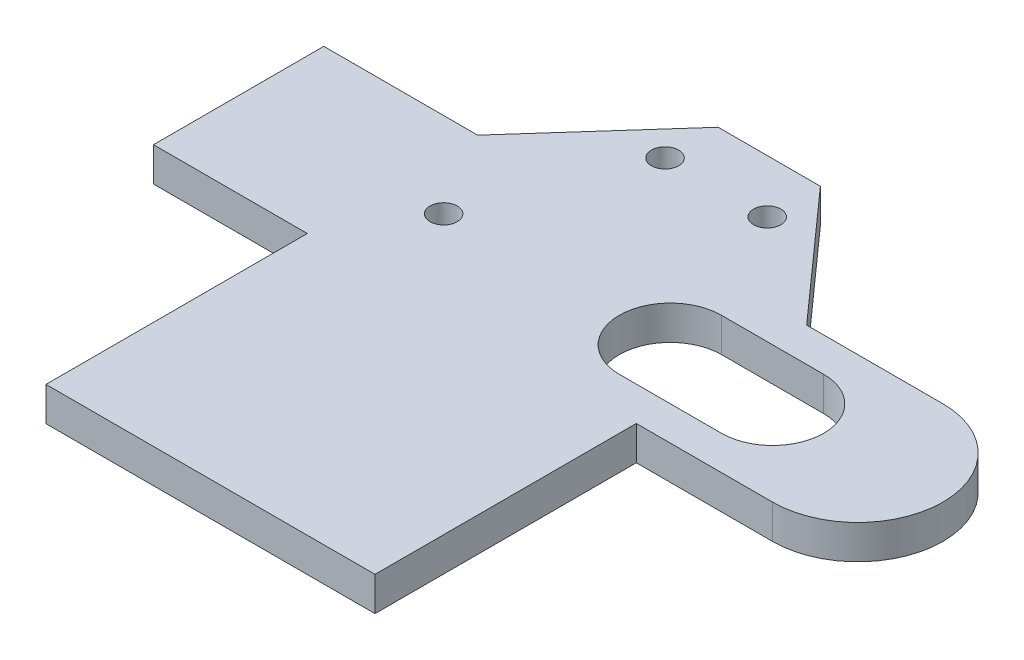
ISO-10303-21;
HEADER;
FILE_DESCRIPTION(('STEP AP214'),'2;1');
FILE_NAME('part.step','',(''),(''),'','','');
FILE_SCHEMA(('AUTOMOTIVE_DESIGN { 1 0 10303 214 1 1 1 1 }'));
ENDSEC;
DATA;
#1=APPLICATION_CONTEXT('core data for automotive mechanical design processes');
#2=APPLICATION_PROTOCOL_DEFINITION('international standard','automotive_design',2000,#1);
#3=PRODUCT_CONTEXT('',#1,'mechanical');
#4=PRODUCT('Part','Part','',(#3));
#5=PRODUCT_RELATED_PRODUCT_CATEGORY('part','',(#4));
#6=PRODUCT_DEFINITION_FORMATION('','',#4);
#7=PRODUCT_DEFINITION_CONTEXT('part definition',#1,'design');
#8=PRODUCT_DEFINITION('design','',#6,#7);
#9=PRODUCT_DEFINITION_SHAPE('','',#8);
#10=(LENGTH_UNIT() NAMED_UNIT(*) SI_UNIT(.MILLI.,.METRE.));
#11=(NAMED_UNIT(*) PLANE_ANGLE_UNIT() SI_UNIT($,.RADIAN.));
#12=(NAMED_UNIT(*) SI_UNIT($,.STERADIAN.) SOLID_ANGLE_UNIT());
#13=UNCERTAINTY_MEASURE_WITH_UNIT(LENGTH_MEASURE(1.E-05),#10,'distance_accuracy_value','');
#14=(GEOMETRIC_REPRESENTATION_CONTEXT(3) GLOBAL_UNCERTAINTY_ASSIGNED_CONTEXT((#13)) GLOBAL_UNIT_ASSIGNED_CONTEXT((#10,
#11,#12)) REPRESENTATION_CONTEXT('',''));
#15=CARTESIAN_POINT('',(0.,0.,0.));
#16=DIRECTION('',(0.,0.,1.));
#17=DIRECTION('',(1.,0.,0.));
#18=AXIS2_PLACEMENT_3D('',#15,#16,#17);
#19=CARTESIAN_POINT('',(64.0800899701705,7.5,-42.8143245307051));
#20=DIRECTION('',(0.,-1.,0.));
#21=DIRECTION('',(0.,0.,-1.));
#22=AXIS2_PLACEMENT_3D('',#19,#20,#21);
#23=PLANE('',#22);
#24=CARTESIAN_POINT('',(3.29581872270843,7.5,-42.8143245307051));
#25=DIRECTION('',(0.,1.,0.));
#26=DIRECTION('',(0.,0.,1.));
#27=AXIS2_PLACEMENT_3D('',#24,#25,#26);
#28=CIRCLE('',#27,2.);
#29=CARTESIAN_POINT('',(3.29581872270843,7.5,-40.8143245307051));
#30=VERTEX_POINT('',#29);
#31=EDGE_CURVE('E183',#30,#30,#28,.T.);
#32=ORIENTED_EDGE('',*,*,#31,.F.);
#33=EDGE_LOOP('',(#32));
#34=FACE_BOUND('',#33,.T.);
#35=CARTESIAN_POINT('',(27.4379543464394,7.5,-66.1721889069742));
#36=DIRECTION('',(0.,1.,0.));
#37=DIRECTION('',(0.,0.,1.));
#38=AXIS2_PLACEMENT_3D('',#35,#36,#37);
#39=CIRCLE('',#38,2.00000000000001);
#40=CARTESIAN_POINT('',(27.4379543464394,7.5,-64.1721889069742));
#41=VERTEX_POINT('',#40);
#42=EDGE_CURVE('E189',#41,#41,#39,.T.);
#43=ORIENTED_EDGE('',*,*,#42,.F.);
#44=EDGE_LOOP('',(#43));
#45=FACE_BOUND('',#44,.T.);
#46=CARTESIAN_POINT('',(12.4379543464394,7.5,-66.1721889069742));
#47=DIRECTION('',(0.,1.,0.));
#48=DIRECTION('',(0.,0.,1.));
#49=AXIS2_PLACEMENT_3D('',#46,#47,#48);
#50=CIRCLE('',#49,2.);
#51=CARTESIAN_POINT('',(12.4379543464394,7.5,-64.1721889069742));
#52=VERTEX_POINT('',#51);
#53=EDGE_CURVE('E195',#52,#52,#50,.T.);
#54=ORIENTED_EDGE('',*,*,#53,.F.);
#55=EDGE_LOOP('',(#54));
#56=FACE_BOUND('',#55,.T.);
#57=DIRECTION('',(1.,0.,0.));
#58=VECTOR('',#57,1.);
#59=CARTESIAN_POINT('',(-26.7817190489237,7.5,-30.314324530705));
#60=LINE('',#59,#58);
#61=CARTESIAN_POINT('',(-26.7817190489237,7.5,-30.314324530705));
#62=VERTEX_POINT('',#61);
#63=CARTESIAN_POINT('',(-4.20418127729161,7.5,-30.314324530705));
#64=VERTEX_POINT('',#63);
#65=EDGE_CURVE('E201',#62,#64,#60,.T.);
#66=ORIENTED_EDGE('',*,*,#65,.T.);
#67=DIRECTION('',(0.,0.,1.));
#68=VECTOR('',#67,1.);
#69=CARTESIAN_POINT('',(-4.20418127729161,7.5,-30.314324530705));
#70=LINE('',#69,#68);
#71=CARTESIAN_POINT('',(-4.20418127729161,7.5,8.03564078339432));
#72=VERTEX_POINT('',#71);
#73=EDGE_CURVE('E204',#64,#72,#70,.T.);
#74=ORIENTED_EDGE('',*,*,#73,.T.);
#75=DIRECTION('',(1.,0.,0.));
#76=VECTOR('',#75,1.);
#77=CARTESIAN_POINT('',(-4.20418127729161,7.5,8.03564078339432));
#78=LINE('',#77,#76);
#79=CARTESIAN_POINT('',(44.0800899701705,7.5,8.03564078339432));
#80=VERTEX_POINT('',#79);
#81=EDGE_CURVE('E207',#72,#80,#78,.T.);
#82=ORIENTED_EDGE('',*,*,#81,.T.);
#83=DIRECTION('',(0.,0.,-1.));
#84=VECTOR('',#83,1.);
#85=CARTESIAN_POINT('',(44.0800899701705,7.5,8.03564078339432));
#86=LINE('',#85,#84);
#87=CARTESIAN_POINT('',(44.0800899701705,7.5,-30.3143245307051));
#88=VERTEX_POINT('',#87);
#89=EDGE_CURVE('E209',#80,#88,#86,.T.);
#90=ORIENTED_EDGE('',*,*,#89,.T.);
#91=DIRECTION('',(1.,0.,0.));
#92=VECTOR('',#91,1.);
#93=CARTESIAN_POINT('',(64.0800899701705,7.5,-30.3143245307051));
#94=LINE('',#93,#92);
#95=CARTESIAN_POINT('',(64.0800899701705,7.5,-30.3143245307051));
#96=VERTEX_POINT('',#95);
#97=EDGE_CURVE('E211',#88,#96,#94,.T.);
#98=ORIENTED_EDGE('',*,*,#97,.T.);
#99=CARTESIAN_POINT('',(64.0800899701705,7.5,-42.8143245307051));
#100=DIRECTION('',(0.,1.,0.));
#101=DIRECTION('',(0.,0.,-1.));
#102=AXIS2_PLACEMENT_3D('',#99,#100,#101);
#103=CIRCLE('',#102,12.5);
#104=CARTESIAN_POINT('',(64.0800899701705,7.5,-55.3143245307051));
#105=VERTEX_POINT('',#104);
#106=EDGE_CURVE('E213',#96,#105,#103,.T.);
#107=ORIENTED_EDGE('',*,*,#106,.T.);
#108=DIRECTION('',(-1.,0.,0.));
#109=VECTOR('',#108,1.);
#110=CARTESIAN_POINT('',(44.0800899701705,7.5,-55.3143245307051));
#111=LINE('',#110,#109);
#112=CARTESIAN_POINT('',(44.0800899701705,7.5,-55.3143245307051));
#113=VERTEX_POINT('',#112);
#114=EDGE_CURVE('E215',#105,#113,#111,.T.);
#115=ORIENTED_EDGE('',*,*,#114,.T.);
#116=DIRECTION('',(-0.665685424949243,0.,-0.746232480538167));
#117=VECTOR('',#116,1.);
#118=CARTESIAN_POINT('',(27.4379543464394,7.5,-73.9701365441592));
#119=LINE('',#118,#117);
#120=CARTESIAN_POINT('',(27.4379543464394,7.5,-73.9701365441592));
#121=VERTEX_POINT('',#120);
#122=EDGE_CURVE('E217',#113,#121,#119,.T.);
#123=ORIENTED_EDGE('',*,*,#122,.T.);
#124=DIRECTION('',(-1.,0.,0.));
#125=VECTOR('',#124,1.);
#126=CARTESIAN_POINT('',(12.4379543464394,7.5,-73.9701365441592));
#127=LINE('',#126,#125);
#128=CARTESIAN_POINT('',(12.4379543464394,7.5,-73.9701365441592));
#129=VERTEX_POINT('',#128);
#130=EDGE_CURVE('E219',#121,#129,#127,.T.);
#131=ORIENTED_EDGE('',*,*,#130,.T.);
#132=DIRECTION('',(-0.665685424949241,0.,0.746232480538169));
#133=VECTOR('',#132,1.);
#134=CARTESIAN_POINT('',(-4.20418127729161,7.5,-55.314324530705));
#135=LINE('',#134,#133);
#136=CARTESIAN_POINT('',(-4.20418127729161,7.5,-55.314324530705));
#137=VERTEX_POINT('',#136);
#138=EDGE_CURVE('E221',#129,#137,#135,.T.);
#139=ORIENTED_EDGE('',*,*,#138,.T.);
#140=DIRECTION('',(-1.,0.,0.));
#141=VECTOR('',#140,1.);
#142=CARTESIAN_POINT('',(-4.20418127729161,7.5,-55.314324530705));
#143=LINE('',#142,#141);
#144=CARTESIAN_POINT('',(-26.7817190489237,7.5,-55.314324530705));
#145=VERTEX_POINT('',#144);
#146=EDGE_CURVE('E223',#137,#145,#143,.T.);
#147=ORIENTED_EDGE('',*,*,#146,.T.);
#148=DIRECTION('',(0.,0.,1.));
#149=VECTOR('',#148,1.);
#150=CARTESIAN_POINT('',(-26.7817190489237,7.5,-55.314324530705));
#151=LINE('',#150,#149);
#152=EDGE_CURVE('E225',#145,#62,#151,.T.);
#153=ORIENTED_EDGE('',*,*,#152,.T.);
#154=EDGE_LOOP('',(#66,#74,#82,#90,#98,#107,#115,#123,#131,#139,#147,#153));
#155=FACE_BOUND('',#154,.T.);
#156=CARTESIAN_POINT('',(36.5800899701705,7.5,-42.8143245307051));
#157=DIRECTION('',(0.,1.,0.));
#158=DIRECTION('',(0.,0.,1.));
#159=AXIS2_PLACEMENT_3D('',#156,#157,#158);
#160=CIRCLE('',#159,7.5);
#161=CARTESIAN_POINT('',(36.5800899701705,7.5,-50.3143245307051));
#162=VERTEX_POINT('',#161);
#163=CARTESIAN_POINT('',(36.5800899701705,7.5,-35.3143245307051));
#164=VERTEX_POINT('',#163);
#165=EDGE_CURVE('E147',#162,#164,#160,.T.);
#166=ORIENTED_EDGE('',*,*,#165,.F.);
#167=DIRECTION('',(-1.,0.,0.));
#168=VECTOR('',#167,1.);
#169=CARTESIAN_POINT('',(36.5800899701705,7.5,-50.3143245307051));
#170=LINE('',#169,#168);
#171=CARTESIAN_POINT('',(51.5800899701705,7.5,-50.3143245307051));
#172=VERTEX_POINT('',#171);
#173=EDGE_CURVE('E169',#172,#162,#170,.T.);
#174=ORIENTED_EDGE('',*,*,#173,.F.);
#175=CARTESIAN_POINT('',(51.5800899701705,7.5,-42.8143245307051));
#176=DIRECTION('',(0.,1.,0.));
#177=DIRECTION('',(0.,0.,1.));
#178=AXIS2_PLACEMENT_3D('',#175,#176,#177);
#179=CIRCLE('',#178,7.5);
#180=CARTESIAN_POINT('',(51.5800899701705,7.5,-35.3143245307051));
#181=VERTEX_POINT('',#180);
#182=EDGE_CURVE('E167',#181,#172,#179,.T.);
#183=ORIENTED_EDGE('',*,*,#182,.F.);
#184=DIRECTION('',(1.,0.,0.));
#185=VECTOR('',#184,1.);
#186=CARTESIAN_POINT('',(36.5800899701705,7.5,-35.3143245307051));
#187=LINE('',#186,#185);
#188=EDGE_CURVE('E155',#164,#181,#187,.T.);
#189=ORIENTED_EDGE('',*,*,#188,.F.);
#190=EDGE_LOOP('',(#166,#174,#183,#189));
#191=FACE_BOUND('',#190,.T.);
#192=ADVANCED_FACE('F34',(#34,#45,#56,#155,#191),#23,.F.);
#193=CARTESIAN_POINT('',(64.0800899701705,2.5,-42.8143245307051));
#194=DIRECTION('',(0.,-1.,0.));
#195=DIRECTION('',(0.,0.,-1.));
#196=AXIS2_PLACEMENT_3D('',#193,#194,#195);
#197=PLANE('',#196);
#198=CARTESIAN_POINT('',(27.4379543464394,2.5,-66.1721889069742));
#199=DIRECTION('',(0.,1.,0.));
#200=DIRECTION('',(0.,0.,1.));
#201=AXIS2_PLACEMENT_3D('',#198,#199,#200);
#202=CIRCLE('',#201,2.00000000000001);
#203=CARTESIAN_POINT('',(27.4379543464394,2.5,-64.1721889069742));
#204=VERTEX_POINT('',#203);
#205=EDGE_CURVE('E186',#204,#204,#202,.T.);
#206=ORIENTED_EDGE('',*,*,#205,.T.);
#207=EDGE_LOOP('',(#206));
#208=FACE_BOUND('',#207,.T.);
#209=DIRECTION('',(1.,0.,0.));
#210=VECTOR('',#209,1.);
#211=CARTESIAN_POINT('',(-26.7817190489237,2.5,-30.314324530705));
#212=LINE('',#211,#210);
#213=CARTESIAN_POINT('',(-26.7817190489237,2.5,-30.314324530705));
#214=VERTEX_POINT('',#213);
#215=CARTESIAN_POINT('',(-4.20418127729161,2.5,-30.314324530705));
#216=VERTEX_POINT('',#215);
#217=EDGE_CURVE('E198',#214,#216,#212,.T.);
#218=ORIENTED_EDGE('',*,*,#217,.F.);
#219=DIRECTION('',(0.,0.,1.));
#220=VECTOR('',#219,1.);
#221=CARTESIAN_POINT('',(-26.7817190489237,2.5,-55.314324530705));
#222=LINE('',#221,#220);
#223=CARTESIAN_POINT('',(-26.7817190489237,2.5,-55.314324530705));
#224=VERTEX_POINT('',#223);
#225=EDGE_CURVE('E205',#224,#214,#222,.T.);
#226=ORIENTED_EDGE('',*,*,#225,.F.);
#227=DIRECTION('',(-1.,0.,0.));
#228=VECTOR('',#227,1.);
#229=CARTESIAN_POINT('',(-4.20418127729161,2.5,-55.314324530705));
#230=LINE('',#229,#228);
#231=CARTESIAN_POINT('',(-4.20418127729161,2.5,-55.314324530705));
#232=VERTEX_POINT('',#231);
#233=EDGE_CURVE('E249',#232,#224,#230,.T.);
#234=ORIENTED_EDGE('',*,*,#233,.F.);
#235=DIRECTION('',(-0.665685424949241,0.,0.746232480538169));
#236=VECTOR('',#235,1.);
#237=CARTESIAN_POINT('',(-4.20418127729161,2.5,-55.314324530705));
#238=LINE('',#237,#236);
#239=CARTESIAN_POINT('',(12.4379543464394,2.5,-73.9701365441592));
#240=VERTEX_POINT('',#239);
#241=EDGE_CURVE('E247',#240,#232,#238,.T.);
#242=ORIENTED_EDGE('',*,*,#241,.F.);
#243=DIRECTION('',(-1.,0.,0.));
#244=VECTOR('',#243,1.);
#245=CARTESIAN_POINT('',(12.4379543464394,2.5,-73.9701365441592));
#246=LINE('',#245,#244);
#247=CARTESIAN_POINT('',(27.4379543464394,2.5,-73.9701365441592));
#248=VERTEX_POINT('',#247);
#249=EDGE_CURVE('E245',#248,#240,#246,.T.);
#250=ORIENTED_EDGE('',*,*,#249,.F.);
#251=DIRECTION('',(-0.665685424949243,0.,-0.746232480538167));
#252=VECTOR('',#251,1.);
#253=CARTESIAN_POINT('',(27.4379543464394,2.5,-73.9701365441592));
#254=LINE('',#253,#252);
#255=CARTESIAN_POINT('',(44.0800899701705,2.5,-55.3143245307051));
#256=VERTEX_POINT('',#255);
#257=EDGE_CURVE('E243',#256,#248,#254,.T.);
#258=ORIENTED_EDGE('',*,*,#257,.F.);
#259=DIRECTION('',(-1.,0.,0.));
#260=VECTOR('',#259,1.);
#261=CARTESIAN_POINT('',(44.0800899701705,2.5,-55.3143245307051));
#262=LINE('',#261,#260);
#263=CARTESIAN_POINT('',(64.0800899701705,2.5,-55.3143245307051));
#264=VERTEX_POINT('',#263);
#265=EDGE_CURVE('E241',#264,#256,#262,.T.);
#266=ORIENTED_EDGE('',*,*,#265,.F.);
#267=CARTESIAN_POINT('',(64.0800899701705,2.5,-42.8143245307051));
#268=DIRECTION('',(0.,1.,0.));
#269=DIRECTION('',(0.,0.,-1.));
#270=AXIS2_PLACEMENT_3D('',#267,#268,#269);
#271=CIRCLE('',#270,12.5);
#272=CARTESIAN_POINT('',(64.0800899701705,2.5,-30.3143245307051));
#273=VERTEX_POINT('',#272);
#274=EDGE_CURVE('E239',#273,#264,#271,.T.);
#275=ORIENTED_EDGE('',*,*,#274,.F.);
#276=DIRECTION('',(1.,0.,0.));
#277=VECTOR('',#276,1.);
#278=CARTESIAN_POINT('',(64.0800899701705,2.5,-30.3143245307051));
#279=LINE('',#278,#277);
#280=CARTESIAN_POINT('',(44.0800899701705,2.5,-30.3143245307051));
#281=VERTEX_POINT('',#280);
#282=EDGE_CURVE('E237',#281,#273,#279,.T.);
#283=ORIENTED_EDGE('',*,*,#282,.F.);
#284=DIRECTION('',(0.,0.,-1.));
#285=VECTOR('',#284,1.);
#286=CARTESIAN_POINT('',(44.0800899701705,2.5,8.03564078339432));
#287=LINE('',#286,#285);
#288=CARTESIAN_POINT('',(44.0800899701705,2.5,8.03564078339432));
#289=VERTEX_POINT('',#288);
#290=EDGE_CURVE('E235',#289,#281,#287,.T.);
#291=ORIENTED_EDGE('',*,*,#290,.F.);
#292=DIRECTION('',(1.,0.,0.));
#293=VECTOR('',#292,1.);
#294=CARTESIAN_POINT('',(41.6072682927848,2.5,8.03564078339432));
#295=LINE('',#294,#293);
#296=CARTESIAN_POINT('',(-4.20418127729161,2.5,8.03564078339432));
#297=VERTEX_POINT('',#296);
#298=EDGE_CURVE('E233',#297,#289,#295,.T.);
#299=ORIENTED_EDGE('',*,*,#298,.F.);
#300=DIRECTION('',(0.,0.,1.));
#301=VECTOR('',#300,1.);
#302=CARTESIAN_POINT('',(-4.20418127729161,2.5,-30.314324530705));
#303=LINE('',#302,#301);
#304=EDGE_CURVE('E230',#216,#297,#303,.T.);
#305=ORIENTED_EDGE('',*,*,#304,.F.);
#306=EDGE_LOOP('',(#218,#226,#234,#242,#250,#258,#266,#275,#283,#291,#299,#305));
#307=FACE_BOUND('',#306,.T.);
#308=CARTESIAN_POINT('',(12.4379543464394,2.5,-66.1721889069742));
#309=DIRECTION('',(0.,1.,0.));
#310=DIRECTION('',(0.,0.,1.));
#311=AXIS2_PLACEMENT_3D('',#308,#309,#310);
#312=CIRCLE('',#311,2.);
#313=CARTESIAN_POINT('',(12.4379543464394,2.5,-64.1721889069742));
#314=VERTEX_POINT('',#313);
#315=EDGE_CURVE('E192',#314,#314,#312,.T.);
#316=ORIENTED_EDGE('',*,*,#315,.T.);
#317=EDGE_LOOP('',(#316));
#318=FACE_BOUND('',#317,.T.);
#319=CARTESIAN_POINT('',(3.29581872270843,2.5,-42.8143245307051));
#320=DIRECTION('',(0.,1.,0.));
#321=DIRECTION('',(0.,0.,1.));
#322=AXIS2_PLACEMENT_3D('',#319,#320,#321);
#323=CIRCLE('',#322,2.);
#324=CARTESIAN_POINT('',(3.29581872270843,2.5,-40.8143245307051));
#325=VERTEX_POINT('',#324);
#326=EDGE_CURVE('E163',#325,#325,#323,.T.);
#327=ORIENTED_EDGE('',*,*,#326,.T.);
#328=EDGE_LOOP('',(#327));
#329=FACE_BOUND('',#328,.T.);
#330=DIRECTION('',(-1.,0.,0.));
#331=VECTOR('',#330,1.);
#332=CARTESIAN_POINT('',(36.5800899701705,2.5,-50.3143245307051));
#333=LINE('',#332,#331);
#334=CARTESIAN_POINT('',(51.5800899701705,2.5,-50.3143245307051));
#335=VERTEX_POINT('',#334);
#336=CARTESIAN_POINT('',(36.5800899701705,2.5,-50.3143245307051));
#337=VERTEX_POINT('',#336);
#338=EDGE_CURVE('E156',#335,#337,#333,.T.);
#339=ORIENTED_EDGE('',*,*,#338,.T.);
#340=CARTESIAN_POINT('',(36.5800899701705,2.5,-42.8143245307051));
#341=DIRECTION('',(0.,1.,0.));
#342=DIRECTION('',(0.,0.,1.));
#343=AXIS2_PLACEMENT_3D('',#340,#341,#342);
#344=CIRCLE('',#343,7.5);
#345=CARTESIAN_POINT('',(36.5800899701705,2.5,-35.3143245307051));
#346=VERTEX_POINT('',#345);
#347=EDGE_CURVE('E57',#337,#346,#344,.T.);
#348=ORIENTED_EDGE('',*,*,#347,.T.);
#349=DIRECTION('',(1.,0.,0.));
#350=VECTOR('',#349,1.);
#351=CARTESIAN_POINT('',(36.5800899701705,2.5,-35.3143245307051));
#352=LINE('',#351,#350);
#353=CARTESIAN_POINT('',(51.5800899701705,2.5,-35.3143245307051));
#354=VERTEX_POINT('',#353);
#355=EDGE_CURVE('E162',#346,#354,#352,.T.);
#356=ORIENTED_EDGE('',*,*,#355,.T.);
#357=CARTESIAN_POINT('',(51.5800899701705,2.5,-42.8143245307051));
#358=DIRECTION('',(0.,1.,0.));
#359=DIRECTION('',(0.,0.,1.));
#360=AXIS2_PLACEMENT_3D('',#357,#358,#359);
#361=CIRCLE('',#360,7.5);
#362=EDGE_CURVE('E175',#354,#335,#361,.T.);
#363=ORIENTED_EDGE('',*,*,#362,.T.);
#364=EDGE_LOOP('',(#339,#348,#356,#363));
#365=FACE_BOUND('',#364,.T.);
#366=ADVANCED_FACE('F291',(#208,#307,#318,#329,#365),#197,.T.);
#367=CARTESIAN_POINT('',(-26.7817190489237,7.5,-30.314324530705));
#368=DIRECTION('',(0.,0.,-1.));
#369=DIRECTION('',(-1.,0.,0.));
#370=AXIS2_PLACEMENT_3D('',#367,#368,#369);
#371=PLANE('',#370);
#372=ORIENTED_EDGE('',*,*,#217,.T.);
#373=DIRECTION('',(0.,-1.,0.));
#374=VECTOR('',#373,1.);
#375=CARTESIAN_POINT('',(-4.20418127729161,7.5,-30.314324530705));
#376=LINE('',#375,#374);
#377=EDGE_CURVE('E11',#64,#216,#376,.T.);
#378=ORIENTED_EDGE('',*,*,#377,.F.);
#379=ORIENTED_EDGE('',*,*,#65,.F.);
#380=DIRECTION('',(0.,-1.,0.));
#381=VECTOR('',#380,1.);
#382=CARTESIAN_POINT('',(-26.7817190489237,7.5,-30.314324530705));
#383=LINE('',#382,#381);
#384=EDGE_CURVE('E227',#62,#214,#383,.T.);
#385=ORIENTED_EDGE('',*,*,#384,.T.);
#386=EDGE_LOOP('',(#372,#378,#379,#385));
#387=FACE_BOUND('',#386,.T.);
#388=ADVANCED_FACE('F36',(#387),#371,.F.);
#389=CARTESIAN_POINT('',(-4.20418127729161,7.5,-30.314324530705));
#390=DIRECTION('',(1.,0.,0.));
#391=DIRECTION('',(0.,0.,-1.));
#392=AXIS2_PLACEMENT_3D('',#389,#390,#391);
#393=PLANE('',#392);
#394=ORIENTED_EDGE('',*,*,#304,.T.);
#395=DIRECTION('',(0.,-1.,0.));
#396=VECTOR('',#395,1.);
#397=CARTESIAN_POINT('',(-4.20418127729161,7.5,8.03564078339432));
#398=LINE('',#397,#396);
#399=EDGE_CURVE('E42',#72,#297,#398,.T.);
#400=ORIENTED_EDGE('',*,*,#399,.F.);
#401=ORIENTED_EDGE('',*,*,#73,.F.);
#402=ORIENTED_EDGE('',*,*,#377,.T.);
#403=EDGE_LOOP('',(#394,#400,#401,#402));
#404=FACE_BOUND('',#403,.T.);
#405=ADVANCED_FACE('F287',(#404),#393,.F.);
#406=CARTESIAN_POINT('',(41.6072682927848,7.5,8.03564078339432));
#407=DIRECTION('',(0.,0.,-1.));
#408=DIRECTION('',(-1.,0.,0.));
#409=AXIS2_PLACEMENT_3D('',#406,#407,#408);
#410=PLANE('',#409);
#411=ORIENTED_EDGE('',*,*,#298,.T.);
#412=DIRECTION('',(0.,-1.,0.));
#413=VECTOR('',#412,1.);
#414=CARTESIAN_POINT('',(44.0800899701705,7.5,8.03564078339432));
#415=LINE('',#414,#413);
#416=EDGE_CURVE('E278',#80,#289,#415,.T.);
#417=ORIENTED_EDGE('',*,*,#416,.F.);
#418=ORIENTED_EDGE('',*,*,#81,.F.);
#419=ORIENTED_EDGE('',*,*,#399,.T.);
#420=EDGE_LOOP('',(#411,#417,#418,#419));
#421=FACE_BOUND('',#420,.T.);
#422=ADVANCED_FACE('F284',(#421),#410,.F.);
#423=CARTESIAN_POINT('',(44.0800899701705,7.5,8.03564078339432));
#424=DIRECTION('',(-1.,0.,0.));
#425=DIRECTION('',(0.,0.,1.));
#426=AXIS2_PLACEMENT_3D('',#423,#424,#425);
#427=PLANE('',#426);
#428=ORIENTED_EDGE('',*,*,#290,.T.);
#429=DIRECTION('',(0.,-1.,0.));
#430=VECTOR('',#429,1.);
#431=CARTESIAN_POINT('',(44.0800899701705,7.5,-30.3143245307051));
#432=LINE('',#431,#430);
#433=EDGE_CURVE('E275',#88,#281,#432,.T.);
#434=ORIENTED_EDGE('',*,*,#433,.F.);
#435=ORIENTED_EDGE('',*,*,#89,.F.);
#436=ORIENTED_EDGE('',*,*,#416,.T.);
#437=EDGE_LOOP('',(#428,#434,#435,#436));
#438=FACE_BOUND('',#437,.T.);
#439=ADVANCED_FACE('F299',(#438),#427,.F.);
#440=CARTESIAN_POINT('',(64.0800899701705,7.5,-30.3143245307051));
#441=DIRECTION('',(0.,0.,-1.));
#442=DIRECTION('',(-1.,0.,0.));
#443=AXIS2_PLACEMENT_3D('',#440,#441,#442);
#444=PLANE('',#443);
#445=ORIENTED_EDGE('',*,*,#282,.T.);
#446=DIRECTION('',(0.,-1.,0.));
#447=VECTOR('',#446,1.);
#448=CARTESIAN_POINT('',(64.0800899701705,7.5,-30.3143245307051));
#449=LINE('',#448,#447);
#450=EDGE_CURVE('E272',#96,#273,#449,.T.);
#451=ORIENTED_EDGE('',*,*,#450,.F.);
#452=ORIENTED_EDGE('',*,*,#97,.F.);
#453=ORIENTED_EDGE('',*,*,#433,.T.);
#454=EDGE_LOOP('',(#445,#451,#452,#453));
#455=FACE_BOUND('',#454,.T.);
#456=ADVANCED_FACE('F303',(#455),#444,.F.);
#457=CARTESIAN_POINT('',(64.0800899701705,7.5,-42.8143245307051));
#458=DIRECTION('',(0.,-1.,0.));
#459=DIRECTION('',(0.,0.,-1.));
#460=AXIS2_PLACEMENT_3D('',#457,#458,#459);
#461=CYLINDRICAL_SURFACE('',#460,12.5);
#462=ORIENTED_EDGE('',*,*,#274,.T.);
#463=DIRECTION('',(0.,-1.,0.));
#464=VECTOR('',#463,1.);
#465=CARTESIAN_POINT('',(64.0800899701705,7.5,-55.3143245307051));
#466=LINE('',#465,#464);
#467=EDGE_CURVE('E269',#105,#264,#466,.T.);
#468=ORIENTED_EDGE('',*,*,#467,.F.);
#469=ORIENTED_EDGE('',*,*,#106,.F.);
#470=ORIENTED_EDGE('',*,*,#450,.T.);
#471=EDGE_LOOP('',(#462,#468,#469,#470));
#472=FACE_BOUND('',#471,.T.);
#473=ADVANCED_FACE('F340',(#472),#461,.T.);
#474=CARTESIAN_POINT('',(44.0800899701705,7.5,-55.3143245307051));
#475=DIRECTION('',(0.,0.,1.));
#476=DIRECTION('',(1.,0.,0.));
#477=AXIS2_PLACEMENT_3D('',#474,#475,#476);
#478=PLANE('',#477);
#479=ORIENTED_EDGE('',*,*,#265,.T.);
#480=DIRECTION('',(0.,-1.,0.));
#481=VECTOR('',#480,1.);
#482=CARTESIAN_POINT('',(44.0800899701705,7.5,-55.3143245307051));
#483=LINE('',#482,#481);
#484=EDGE_CURVE('E266',#113,#256,#483,.T.);
#485=ORIENTED_EDGE('',*,*,#484,.F.);
#486=ORIENTED_EDGE('',*,*,#114,.F.);
#487=ORIENTED_EDGE('',*,*,#467,.T.);
#488=EDGE_LOOP('',(#479,#485,#486,#487));
#489=FACE_BOUND('',#488,.T.);
#490=ADVANCED_FACE('F338',(#489),#478,.F.);
#491=CARTESIAN_POINT('',(27.4379543464394,7.5,-73.9701365441592));
#492=DIRECTION('',(-0.746232480538167,0.,0.665685424949243));
#493=DIRECTION('',(0.665685424949243,0.,0.746232480538167));
#494=AXIS2_PLACEMENT_3D('',#491,#492,#493);
#495=PLANE('',#494);
#496=ORIENTED_EDGE('',*,*,#257,.T.);
#497=DIRECTION('',(0.,-1.,0.));
#498=VECTOR('',#497,1.);
#499=CARTESIAN_POINT('',(27.4379543464394,7.5,-73.9701365441592));
#500=LINE('',#499,#498);
#501=EDGE_CURVE('E263',#121,#248,#500,.T.);
#502=ORIENTED_EDGE('',*,*,#501,.F.);
#503=ORIENTED_EDGE('',*,*,#122,.F.);
#504=ORIENTED_EDGE('',*,*,#484,.T.);
#505=EDGE_LOOP('',(#496,#502,#503,#504));
#506=FACE_BOUND('',#505,.T.);
#507=ADVANCED_FACE('F333',(#506),#495,.F.);
#508=CARTESIAN_POINT('',(12.4379543464394,7.5,-73.9701365441592));
#509=DIRECTION('',(0.,0.,1.));
#510=DIRECTION('',(1.,0.,0.));
#511=AXIS2_PLACEMENT_3D('',#508,#509,#510);
#512=PLANE('',#511);
#513=ORIENTED_EDGE('',*,*,#249,.T.);
#514=DIRECTION('',(0.,-1.,0.));
#515=VECTOR('',#514,1.);
#516=CARTESIAN_POINT('',(12.4379543464394,7.5,-73.9701365441592));
#517=LINE('',#516,#515);
#518=EDGE_CURVE('E260',#129,#240,#517,.T.);
#519=ORIENTED_EDGE('',*,*,#518,.F.);
#520=ORIENTED_EDGE('',*,*,#130,.F.);
#521=ORIENTED_EDGE('',*,*,#501,.T.);
#522=EDGE_LOOP('',(#513,#519,#520,#521));
#523=FACE_BOUND('',#522,.T.);
#524=ADVANCED_FACE('F328',(#523),#512,.F.);
#525=CARTESIAN_POINT('',(-4.20418127729161,7.5,-55.314324530705));
#526=DIRECTION('',(0.746232480538169,0.,0.665685424949241));
#527=DIRECTION('',(0.665685424949241,0.,-0.746232480538169));
#528=AXIS2_PLACEMENT_3D('',#525,#526,#527);
#529=PLANE('',#528);
#530=ORIENTED_EDGE('',*,*,#241,.T.);
#531=DIRECTION('',(0.,-1.,0.));
#532=VECTOR('',#531,1.);
#533=CARTESIAN_POINT('',(-4.20418127729161,7.5,-55.314324530705));
#534=LINE('',#533,#532);
#535=EDGE_CURVE('E257',#137,#232,#534,.T.);
#536=ORIENTED_EDGE('',*,*,#535,.F.);
#537=ORIENTED_EDGE('',*,*,#138,.F.);
#538=ORIENTED_EDGE('',*,*,#518,.T.);
#539=EDGE_LOOP('',(#530,#536,#537,#538));
#540=FACE_BOUND('',#539,.T.);
#541=ADVANCED_FACE('F324',(#540),#529,.F.);
#542=CARTESIAN_POINT('',(-4.20418127729161,7.5,-55.314324530705));
#543=DIRECTION('',(0.,0.,1.));
#544=DIRECTION('',(1.,0.,0.));
#545=AXIS2_PLACEMENT_3D('',#542,#543,#544);
#546=PLANE('',#545);
#547=ORIENTED_EDGE('',*,*,#233,.T.);
#548=DIRECTION('',(0.,-1.,0.));
#549=VECTOR('',#548,1.);
#550=CARTESIAN_POINT('',(-26.7817190489237,7.5,-55.314324530705));
#551=LINE('',#550,#549);
#552=EDGE_CURVE('E254',#145,#224,#551,.T.);
#553=ORIENTED_EDGE('',*,*,#552,.F.);
#554=ORIENTED_EDGE('',*,*,#146,.F.);
#555=ORIENTED_EDGE('',*,*,#535,.T.);
#556=EDGE_LOOP('',(#547,#553,#554,#555));
#557=FACE_BOUND('',#556,.T.);
#558=ADVANCED_FACE('F319',(#557),#546,.F.);
#559=CARTESIAN_POINT('',(-26.7817190489237,7.5,-55.314324530705));
#560=DIRECTION('',(1.,0.,0.));
#561=DIRECTION('',(0.,0.,-1.));
#562=AXIS2_PLACEMENT_3D('',#559,#560,#561);
#563=PLANE('',#562);
#564=ORIENTED_EDGE('',*,*,#225,.T.);
#565=ORIENTED_EDGE('',*,*,#384,.F.);
#566=ORIENTED_EDGE('',*,*,#152,.F.);
#567=ORIENTED_EDGE('',*,*,#552,.T.);
#568=EDGE_LOOP('',(#564,#565,#566,#567));
#569=FACE_BOUND('',#568,.T.);
#570=ADVANCED_FACE('F313',(#569),#563,.F.);
#571=CARTESIAN_POINT('',(12.4379543464394,7.5,-66.1721889069742));
#572=DIRECTION('',(0.,-1.,0.));
#573=DIRECTION('',(0.,0.,-1.));
#574=AXIS2_PLACEMENT_3D('',#571,#572,#573);
#575=CYLINDRICAL_SURFACE('',#574,2.);
#576=ORIENTED_EDGE('',*,*,#53,.T.);
#577=EDGE_LOOP('',(#576));
#578=FACE_BOUND('',#577,.T.);
#579=ORIENTED_EDGE('',*,*,#315,.F.);
#580=EDGE_LOOP('',(#579));
#581=FACE_BOUND('',#580,.T.);
#582=ADVANCED_FACE('F360',(#578,#581),#575,.F.);
#583=CARTESIAN_POINT('',(27.4379543464394,7.5,-66.1721889069742));
#584=DIRECTION('',(0.,-1.,0.));
#585=DIRECTION('',(0.,0.,-1.));
#586=AXIS2_PLACEMENT_3D('',#583,#584,#585);
#587=CYLINDRICAL_SURFACE('',#586,2.00000000000001);
#588=ORIENTED_EDGE('',*,*,#42,.T.);
#589=EDGE_LOOP('',(#588));
#590=FACE_BOUND('',#589,.T.);
#591=ORIENTED_EDGE('',*,*,#205,.F.);
#592=EDGE_LOOP('',(#591));
#593=FACE_BOUND('',#592,.T.);
#594=ADVANCED_FACE('F398',(#590,#593),#587,.F.);
#595=CARTESIAN_POINT('',(3.29581872270843,7.5,-42.8143245307051));
#596=DIRECTION('',(0.,-1.,0.));
#597=DIRECTION('',(0.,0.,-1.));
#598=AXIS2_PLACEMENT_3D('',#595,#596,#597);
#599=CYLINDRICAL_SURFACE('',#598,2.);
#600=ORIENTED_EDGE('',*,*,#31,.T.);
#601=EDGE_LOOP('',(#600));
#602=FACE_BOUND('',#601,.T.);
#603=ORIENTED_EDGE('',*,*,#326,.F.);
#604=EDGE_LOOP('',(#603));
#605=FACE_BOUND('',#604,.T.);
#606=ADVANCED_FACE('F405',(#602,#605),#599,.F.);
#607=CARTESIAN_POINT('',(36.5800899701705,7.5,-42.8143245307051));
#608=DIRECTION('',(0.,-1.,0.));
#609=DIRECTION('',(0.,0.,-1.));
#610=AXIS2_PLACEMENT_3D('',#607,#608,#609);
#611=CYLINDRICAL_SURFACE('',#610,7.5);
#612=ORIENTED_EDGE('',*,*,#347,.F.);
#613=DIRECTION('',(0.,-1.,0.));
#614=VECTOR('',#613,1.);
#615=CARTESIAN_POINT('',(36.5800899701705,7.5,-50.3143245307051));
#616=LINE('',#615,#614);
#617=EDGE_CURVE('E151',#162,#337,#616,.T.);
#618=ORIENTED_EDGE('',*,*,#617,.F.);
#619=ORIENTED_EDGE('',*,*,#165,.T.);
#620=DIRECTION('',(0.,-1.,0.));
#621=VECTOR('',#620,1.);
#622=CARTESIAN_POINT('',(36.5800899701705,7.5,-35.3143245307051));
#623=LINE('',#622,#621);
#624=EDGE_CURVE('E150',#164,#346,#623,.T.);
#625=ORIENTED_EDGE('',*,*,#624,.T.);
#626=EDGE_LOOP('',(#612,#618,#619,#625));
#627=FACE_BOUND('',#626,.T.);
#628=ADVANCED_FACE('F149',(#627),#611,.F.);
#629=CARTESIAN_POINT('',(36.5800899701705,7.5,-35.3143245307051));
#630=DIRECTION('',(0.,0.,-1.));
#631=DIRECTION('',(-1.,0.,0.));
#632=AXIS2_PLACEMENT_3D('',#629,#630,#631);
#633=PLANE('',#632);
#634=ORIENTED_EDGE('',*,*,#355,.F.);
#635=ORIENTED_EDGE('',*,*,#624,.F.);
#636=ORIENTED_EDGE('',*,*,#188,.T.);
#637=DIRECTION('',(0.,-1.,0.));
#638=VECTOR('',#637,1.);
#639=CARTESIAN_POINT('',(51.5800899701705,7.5,-35.3143245307051));
#640=LINE('',#639,#638);
#641=EDGE_CURVE('E164',#181,#354,#640,.T.);
#642=ORIENTED_EDGE('',*,*,#641,.T.);
#643=EDGE_LOOP('',(#634,#635,#636,#642));
#644=FACE_BOUND('',#643,.T.);
#645=ADVANCED_FACE('F159',(#644),#633,.T.);
#646=CARTESIAN_POINT('',(51.5800899701705,7.5,-42.8143245307051));
#647=DIRECTION('',(0.,-1.,0.));
#648=DIRECTION('',(0.,0.,-1.));
#649=AXIS2_PLACEMENT_3D('',#646,#647,#648);
#650=CYLINDRICAL_SURFACE('',#649,7.5);
#651=ORIENTED_EDGE('',*,*,#362,.F.);
#652=ORIENTED_EDGE('',*,*,#641,.F.);
#653=ORIENTED_EDGE('',*,*,#182,.T.);
#654=DIRECTION('',(0.,-1.,0.));
#655=VECTOR('',#654,1.);
#656=CARTESIAN_POINT('',(51.5800899701705,7.5,-50.3143245307051));
#657=LINE('',#656,#655);
#658=EDGE_CURVE('E49',#172,#335,#657,.T.);
#659=ORIENTED_EDGE('',*,*,#658,.T.);
#660=EDGE_LOOP('',(#651,#652,#653,#659));
#661=FACE_BOUND('',#660,.T.);
#662=ADVANCED_FACE('F425',(#661),#650,.F.);
#663=CARTESIAN_POINT('',(36.5800899701705,7.5,-50.3143245307051));
#664=DIRECTION('',(0.,0.,1.));
#665=DIRECTION('',(1.,0.,0.));
#666=AXIS2_PLACEMENT_3D('',#663,#664,#665);
#667=PLANE('',#666);
#668=ORIENTED_EDGE('',*,*,#338,.F.);
#669=ORIENTED_EDGE('',*,*,#658,.F.);
#670=ORIENTED_EDGE('',*,*,#173,.T.);
#671=ORIENTED_EDGE('',*,*,#617,.T.);
#672=EDGE_LOOP('',(#668,#669,#670,#671));
#673=FACE_BOUND('',#672,.T.);
#674=ADVANCED_FACE('F432',(#673),#667,.T.);
#675=CLOSED_SHELL('',(#192,#366,#388,#405,#422,#439,#456,#473,#490,#507,#524,#541,#558,#570,
#582,#594,#606,#628,#645,#662,#674));
#676=MANIFOLD_SOLID_BREP('B2',#675);
#677=ADVANCED_BREP_SHAPE_REPRESENTATION('',(#18,#676),#14);
#678=SHAPE_DEFINITION_REPRESENTATION(#9,#677);
ENDSEC;
END-ISO-10303-21;
